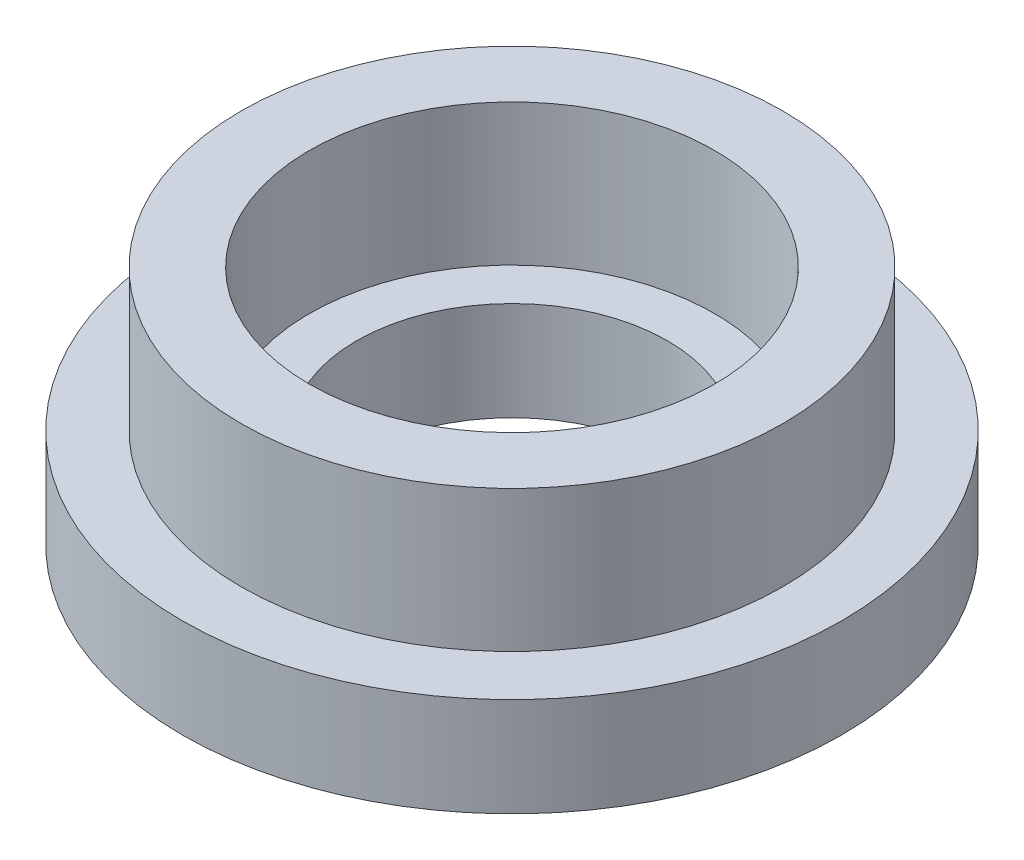
ISO-10303-21;
HEADER;
FILE_DESCRIPTION(('STEP AP214'),'2;1');
FILE_NAME('part.step','',(''),(''),'','','');
FILE_SCHEMA(('AUTOMOTIVE_DESIGN { 1 0 10303 214 1 1 1 1 }'));
ENDSEC;
DATA;
#1=APPLICATION_CONTEXT('core data for automotive mechanical design processes');
#2=APPLICATION_PROTOCOL_DEFINITION('international standard','automotive_design',2000,#1);
#3=PRODUCT_CONTEXT('',#1,'mechanical');
#4=PRODUCT('Part','Part','',(#3));
#5=PRODUCT_RELATED_PRODUCT_CATEGORY('part','',(#4));
#6=PRODUCT_DEFINITION_FORMATION('','',#4);
#7=PRODUCT_DEFINITION_CONTEXT('part definition',#1,'design');
#8=PRODUCT_DEFINITION('design','',#6,#7);
#9=PRODUCT_DEFINITION_SHAPE('','',#8);
#10=(LENGTH_UNIT() NAMED_UNIT(*) SI_UNIT(.MILLI.,.METRE.));
#11=(NAMED_UNIT(*) PLANE_ANGLE_UNIT() SI_UNIT($,.RADIAN.));
#12=(NAMED_UNIT(*) SI_UNIT($,.STERADIAN.) SOLID_ANGLE_UNIT());
#13=UNCERTAINTY_MEASURE_WITH_UNIT(LENGTH_MEASURE(1.E-05),#10,'distance_accuracy_value','');
#14=(GEOMETRIC_REPRESENTATION_CONTEXT(3) GLOBAL_UNCERTAINTY_ASSIGNED_CONTEXT((#13)) GLOBAL_UNIT_ASSIGNED_CONTEXT((#10,
#11,#12)) REPRESENTATION_CONTEXT('',''));
#15=CARTESIAN_POINT('',(0.,0.,0.));
#16=DIRECTION('',(0.,0.,1.));
#17=DIRECTION('',(1.,0.,0.));
#18=AXIS2_PLACEMENT_3D('',#15,#16,#17);
#19=CARTESIAN_POINT('',(0.,55.,0.));
#20=DIRECTION('',(0.,1.,0.));
#21=DIRECTION('',(0.,0.,1.));
#22=AXIS2_PLACEMENT_3D('',#19,#20,#21);
#23=CYLINDRICAL_SURFACE('',#22,5.75);
#24=CARTESIAN_POINT('',(0.,0.,0.));
#25=DIRECTION('',(0.,1.,0.));
#26=DIRECTION('',(0.,0.,1.));
#27=AXIS2_PLACEMENT_3D('',#24,#25,#26);
#28=CIRCLE('',#27,5.75);
#29=CARTESIAN_POINT('',(0.,0.,5.75));
#30=VERTEX_POINT('',#29);
#31=EDGE_CURVE('E10',#30,#30,#28,.T.);
#32=ORIENTED_EDGE('',*,*,#31,.T.);
#33=EDGE_LOOP('',(#32));
#34=FACE_BOUND('',#33,.T.);
#35=CARTESIAN_POINT('',(0.,3.,0.));
#36=DIRECTION('',(0.,1.,0.));
#37=DIRECTION('',(0.,0.,1.));
#38=AXIS2_PLACEMENT_3D('',#35,#36,#37);
#39=CIRCLE('',#38,5.75);
#40=CARTESIAN_POINT('',(0.,3.,5.75));
#41=VERTEX_POINT('',#40);
#42=EDGE_CURVE('E72',#41,#41,#39,.T.);
#43=ORIENTED_EDGE('',*,*,#42,.F.);
#44=EDGE_LOOP('',(#43));
#45=FACE_BOUND('',#44,.T.);
#46=ADVANCED_FACE('F37',(#34,#45),#23,.T.);
#47=CARTESIAN_POINT('',(-7.,0.,0.));
#48=DIRECTION('',(0.,1.,0.));
#49=DIRECTION('',(0.,0.,1.));
#50=AXIS2_PLACEMENT_3D('',#47,#48,#49);
#51=PLANE('',#50);
#52=CARTESIAN_POINT('',(0.,0.,0.));
#53=DIRECTION('',(0.,1.,0.));
#54=DIRECTION('',(0.,0.,1.));
#55=AXIS2_PLACEMENT_3D('',#52,#53,#54);
#56=CIRCLE('',#55,7.);
#57=CARTESIAN_POINT('',(0.,0.,7.));
#58=VERTEX_POINT('',#57);
#59=EDGE_CURVE('E44',#58,#58,#56,.T.);
#60=ORIENTED_EDGE('',*,*,#59,.T.);
#61=EDGE_LOOP('',(#60));
#62=FACE_BOUND('',#61,.T.);
#63=ORIENTED_EDGE('',*,*,#31,.F.);
#64=EDGE_LOOP('',(#63));
#65=FACE_BOUND('',#64,.T.);
#66=ADVANCED_FACE('F81',(#62,#65),#51,.T.);
#67=CARTESIAN_POINT('',(0.,55.,0.));
#68=DIRECTION('',(0.,1.,0.));
#69=DIRECTION('',(0.,0.,1.));
#70=AXIS2_PLACEMENT_3D('',#67,#68,#69);
#71=CYLINDRICAL_SURFACE('',#70,7.);
#72=CARTESIAN_POINT('',(0.,-2.1,0.));
#73=DIRECTION('',(0.,1.,0.));
#74=DIRECTION('',(0.,0.,1.));
#75=AXIS2_PLACEMENT_3D('',#72,#73,#74);
#76=CIRCLE('',#75,7.);
#77=CARTESIAN_POINT('',(0.,-2.1,7.));
#78=VERTEX_POINT('',#77);
#79=EDGE_CURVE('E49',#78,#78,#76,.T.);
#80=ORIENTED_EDGE('',*,*,#79,.T.);
#81=EDGE_LOOP('',(#80));
#82=FACE_BOUND('',#81,.T.);
#83=ORIENTED_EDGE('',*,*,#59,.F.);
#84=EDGE_LOOP('',(#83));
#85=FACE_BOUND('',#84,.T.);
#86=ADVANCED_FACE('F85',(#82,#85),#71,.T.);
#87=CARTESIAN_POINT('',(-7.,-2.1,0.));
#88=DIRECTION('',(0.,-1.,0.));
#89=DIRECTION('',(0.,0.,-1.));
#90=AXIS2_PLACEMENT_3D('',#87,#88,#89);
#91=PLANE('',#90);
#92=CARTESIAN_POINT('',(0.,-2.1,0.));
#93=DIRECTION('',(0.,1.,0.));
#94=DIRECTION('',(0.,0.,1.));
#95=AXIS2_PLACEMENT_3D('',#92,#93,#94);
#96=CIRCLE('',#95,3.3);
#97=CARTESIAN_POINT('',(0.,-2.1,3.3));
#98=VERTEX_POINT('',#97);
#99=EDGE_CURVE('E54',#98,#98,#96,.T.);
#100=ORIENTED_EDGE('',*,*,#99,.T.);
#101=EDGE_LOOP('',(#100));
#102=FACE_BOUND('',#101,.T.);
#103=ORIENTED_EDGE('',*,*,#79,.F.);
#104=EDGE_LOOP('',(#103));
#105=FACE_BOUND('',#104,.T.);
#106=ADVANCED_FACE('F89',(#102,#105),#91,.T.);
#107=CARTESIAN_POINT('',(0.,55.,0.));
#108=DIRECTION('',(0.,1.,0.));
#109=DIRECTION('',(0.,0.,1.));
#110=AXIS2_PLACEMENT_3D('',#107,#108,#109);
#111=CYLINDRICAL_SURFACE('',#110,3.3);
#112=CARTESIAN_POINT('',(0.,0.,0.));
#113=DIRECTION('',(0.,1.,0.));
#114=DIRECTION('',(0.,0.,1.));
#115=AXIS2_PLACEMENT_3D('',#112,#113,#114);
#116=CIRCLE('',#115,3.3);
#117=CARTESIAN_POINT('',(0.,0.,3.3));
#118=VERTEX_POINT('',#117);
#119=EDGE_CURVE('E60',#118,#118,#116,.T.);
#120=ORIENTED_EDGE('',*,*,#119,.T.);
#121=EDGE_LOOP('',(#120));
#122=FACE_BOUND('',#121,.T.);
#123=ORIENTED_EDGE('',*,*,#99,.F.);
#124=EDGE_LOOP('',(#123));
#125=FACE_BOUND('',#124,.T.);
#126=ADVANCED_FACE('F96',(#122,#125),#111,.F.);
#127=CARTESIAN_POINT('',(-4.3,0.,0.));
#128=DIRECTION('',(0.,1.,0.));
#129=DIRECTION('',(0.,0.,1.));
#130=AXIS2_PLACEMENT_3D('',#127,#128,#129);
#131=PLANE('',#130);
#132=CARTESIAN_POINT('',(0.,0.,0.));
#133=DIRECTION('',(0.,1.,0.));
#134=DIRECTION('',(0.,0.,1.));
#135=AXIS2_PLACEMENT_3D('',#132,#133,#134);
#136=CIRCLE('',#135,4.3);
#137=CARTESIAN_POINT('',(0.,0.,4.3));
#138=VERTEX_POINT('',#137);
#139=EDGE_CURVE('E64',#138,#138,#136,.T.);
#140=ORIENTED_EDGE('',*,*,#139,.T.);
#141=EDGE_LOOP('',(#140));
#142=FACE_BOUND('',#141,.T.);
#143=ORIENTED_EDGE('',*,*,#119,.F.);
#144=EDGE_LOOP('',(#143));
#145=FACE_BOUND('',#144,.T.);
#146=ADVANCED_FACE('F100',(#142,#145),#131,.T.);
#147=CARTESIAN_POINT('',(0.,55.,0.));
#148=DIRECTION('',(0.,1.,0.));
#149=DIRECTION('',(0.,0.,1.));
#150=AXIS2_PLACEMENT_3D('',#147,#148,#149);
#151=CYLINDRICAL_SURFACE('',#150,4.3);
#152=CARTESIAN_POINT('',(0.,3.,0.));
#153=DIRECTION('',(0.,1.,0.));
#154=DIRECTION('',(0.,0.,1.));
#155=AXIS2_PLACEMENT_3D('',#152,#153,#154);
#156=CIRCLE('',#155,4.3);
#157=CARTESIAN_POINT('',(0.,3.,4.3));
#158=VERTEX_POINT('',#157);
#159=EDGE_CURVE('E68',#158,#158,#156,.T.);
#160=ORIENTED_EDGE('',*,*,#159,.T.);
#161=EDGE_LOOP('',(#160));
#162=FACE_BOUND('',#161,.T.);
#163=ORIENTED_EDGE('',*,*,#139,.F.);
#164=EDGE_LOOP('',(#163));
#165=FACE_BOUND('',#164,.T.);
#166=ADVANCED_FACE('F104',(#162,#165),#151,.F.);
#167=CARTESIAN_POINT('',(-5.75,3.,0.));
#168=DIRECTION('',(0.,1.,0.));
#169=DIRECTION('',(0.,0.,1.));
#170=AXIS2_PLACEMENT_3D('',#167,#168,#169);
#171=PLANE('',#170);
#172=ORIENTED_EDGE('',*,*,#42,.T.);
#173=EDGE_LOOP('',(#172));
#174=FACE_BOUND('',#173,.T.);
#175=ORIENTED_EDGE('',*,*,#159,.F.);
#176=EDGE_LOOP('',(#175));
#177=FACE_BOUND('',#176,.T.);
#178=ADVANCED_FACE('F77',(#174,#177),#171,.T.);
#179=CLOSED_SHELL('',(#46,#66,#86,#106,#126,#146,#166,#178));
#180=MANIFOLD_SOLID_BREP('B2',#179);
#181=ADVANCED_BREP_SHAPE_REPRESENTATION('',(#18,#180),#14);
#182=SHAPE_DEFINITION_REPRESENTATION(#9,#181);
ENDSEC;
END-ISO-10303-21;
